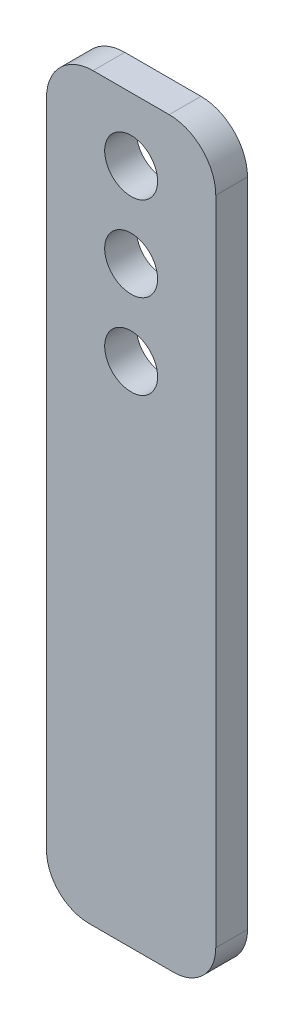
ISO-10303-21;
HEADER;
FILE_DESCRIPTION(('STEP AP214'),'2;1');
FILE_NAME('part.step','',(''),(''),'','','');
FILE_SCHEMA(('AUTOMOTIVE_DESIGN { 1 0 10303 214 1 1 1 1 }'));
ENDSEC;
DATA;
#1=APPLICATION_CONTEXT('core data for automotive mechanical design processes');
#2=APPLICATION_PROTOCOL_DEFINITION('international standard','automotive_design',2000,#1);
#3=PRODUCT_CONTEXT('',#1,'mechanical');
#4=PRODUCT('Part','Part','',(#3));
#5=PRODUCT_RELATED_PRODUCT_CATEGORY('part','',(#4));
#6=PRODUCT_DEFINITION_FORMATION('','',#4);
#7=PRODUCT_DEFINITION_CONTEXT('part definition',#1,'design');
#8=PRODUCT_DEFINITION('design','',#6,#7);
#9=PRODUCT_DEFINITION_SHAPE('','',#8);
#10=(LENGTH_UNIT() NAMED_UNIT(*) SI_UNIT(.MILLI.,.METRE.));
#11=(NAMED_UNIT(*) PLANE_ANGLE_UNIT() SI_UNIT($,.RADIAN.));
#12=(NAMED_UNIT(*) SI_UNIT($,.STERADIAN.) SOLID_ANGLE_UNIT());
#13=UNCERTAINTY_MEASURE_WITH_UNIT(LENGTH_MEASURE(1.E-05),#10,'distance_accuracy_value','');
#14=(GEOMETRIC_REPRESENTATION_CONTEXT(3) GLOBAL_UNCERTAINTY_ASSIGNED_CONTEXT((#13)) GLOBAL_UNIT_ASSIGNED_CONTEXT((#10,
#11,#12)) REPRESENTATION_CONTEXT('',''));
#15=CARTESIAN_POINT('',(0.,0.,0.));
#16=DIRECTION('',(0.,0.,1.));
#17=DIRECTION('',(1.,0.,0.));
#18=AXIS2_PLACEMENT_3D('',#15,#16,#17);
#19=CARTESIAN_POINT('',(18.,-22.,15.));
#20=DIRECTION('',(0.,0.,1.));
#21=DIRECTION('',(1.,0.,0.));
#22=AXIS2_PLACEMENT_3D('',#19,#20,#21);
#23=PLANE('',#22);
#24=CARTESIAN_POINT('',(0.,-70.,15.));
#25=DIRECTION('',(0.,0.,1.));
#26=DIRECTION('',(1.,0.,0.));
#27=AXIS2_PLACEMENT_3D('',#24,#25,#26);
#28=CIRCLE('',#27,12.5);
#29=CARTESIAN_POINT('',(12.5,-70.,15.));
#30=VERTEX_POINT('',#29);
#31=EDGE_CURVE('E160',#30,#30,#28,.T.);
#32=ORIENTED_EDGE('',*,*,#31,.F.);
#33=EDGE_LOOP('',(#32));
#34=FACE_BOUND('',#33,.T.);
#35=CARTESIAN_POINT('',(18.,-22.,15.));
#36=DIRECTION('',(0.,0.,1.));
#37=DIRECTION('',(1.,0.,0.));
#38=AXIS2_PLACEMENT_3D('',#35,#36,#37);
#39=CIRCLE('',#38,22.);
#40=CARTESIAN_POINT('',(40.,-22.,15.));
#41=VERTEX_POINT('',#40);
#42=CARTESIAN_POINT('',(18.,0.,15.));
#43=VERTEX_POINT('',#42);
#44=EDGE_CURVE('E161',#41,#43,#39,.T.);
#45=ORIENTED_EDGE('',*,*,#44,.T.);
#46=DIRECTION('',(-1.,0.,0.));
#47=VECTOR('',#46,1.);
#48=CARTESIAN_POINT('',(-18.,0.,15.));
#49=LINE('',#48,#47);
#50=CARTESIAN_POINT('',(-18.,0.,15.));
#51=VERTEX_POINT('',#50);
#52=EDGE_CURVE('E100',#43,#51,#49,.T.);
#53=ORIENTED_EDGE('',*,*,#52,.T.);
#54=CARTESIAN_POINT('',(-18.,-22.,15.));
#55=DIRECTION('',(0.,0.,1.));
#56=DIRECTION('',(-1.,0.,0.));
#57=AXIS2_PLACEMENT_3D('',#54,#55,#56);
#58=CIRCLE('',#57,22.);
#59=CARTESIAN_POINT('',(-40.,-22.,15.));
#60=VERTEX_POINT('',#59);
#61=EDGE_CURVE('E173',#51,#60,#58,.T.);
#62=ORIENTED_EDGE('',*,*,#61,.T.);
#63=DIRECTION('',(0.,-1.,0.));
#64=VECTOR('',#63,1.);
#65=CARTESIAN_POINT('',(-40.,-330.,15.));
#66=LINE('',#65,#64);
#67=CARTESIAN_POINT('',(-40.,-330.,15.));
#68=VERTEX_POINT('',#67);
#69=EDGE_CURVE('E176',#60,#68,#66,.T.);
#70=ORIENTED_EDGE('',*,*,#69,.T.);
#71=CARTESIAN_POINT('',(-20.,-330.,15.));
#72=DIRECTION('',(0.,0.,1.));
#73=DIRECTION('',(1.,0.,0.));
#74=AXIS2_PLACEMENT_3D('',#71,#72,#73);
#75=CIRCLE('',#74,20.);
#76=CARTESIAN_POINT('',(-20.,-350.,15.));
#77=VERTEX_POINT('',#76);
#78=EDGE_CURVE('E119',#68,#77,#75,.T.);
#79=ORIENTED_EDGE('',*,*,#78,.T.);
#80=DIRECTION('',(1.,0.,0.));
#81=VECTOR('',#80,1.);
#82=CARTESIAN_POINT('',(-20.,-350.,15.));
#83=LINE('',#82,#81);
#84=CARTESIAN_POINT('',(20.,-350.,15.));
#85=VERTEX_POINT('',#84);
#86=EDGE_CURVE('E113',#77,#85,#83,.T.);
#87=ORIENTED_EDGE('',*,*,#86,.T.);
#88=CARTESIAN_POINT('',(20.,-330.,15.));
#89=DIRECTION('',(0.,0.,1.));
#90=DIRECTION('',(-1.,0.,0.));
#91=AXIS2_PLACEMENT_3D('',#88,#89,#90);
#92=CIRCLE('',#91,20.);
#93=CARTESIAN_POINT('',(40.,-330.,15.));
#94=VERTEX_POINT('',#93);
#95=EDGE_CURVE('E117',#85,#94,#92,.T.);
#96=ORIENTED_EDGE('',*,*,#95,.T.);
#97=DIRECTION('',(0.,1.,0.));
#98=VECTOR('',#97,1.);
#99=CARTESIAN_POINT('',(40.,-330.,15.));
#100=LINE('',#99,#98);
#101=EDGE_CURVE('E57',#94,#41,#100,.T.);
#102=ORIENTED_EDGE('',*,*,#101,.T.);
#103=EDGE_LOOP('',(#45,#53,#62,#70,#79,#87,#96,#102));
#104=FACE_BOUND('',#103,.T.);
#105=CARTESIAN_POINT('',(0.,-30.,15.));
#106=DIRECTION('',(0.,0.,1.));
#107=DIRECTION('',(1.,0.,0.));
#108=AXIS2_PLACEMENT_3D('',#105,#106,#107);
#109=CIRCLE('',#108,12.5);
#110=CARTESIAN_POINT('',(12.5,-30.,15.));
#111=VERTEX_POINT('',#110);
#112=EDGE_CURVE('E148',#111,#111,#109,.T.);
#113=ORIENTED_EDGE('',*,*,#112,.F.);
#114=EDGE_LOOP('',(#113));
#115=FACE_BOUND('',#114,.T.);
#116=CARTESIAN_POINT('',(0.,-110.,15.));
#117=DIRECTION('',(0.,0.,1.));
#118=DIRECTION('',(1.,0.,0.));
#119=AXIS2_PLACEMENT_3D('',#116,#117,#118);
#120=CIRCLE('',#119,12.5);
#121=CARTESIAN_POINT('',(12.5,-110.,15.));
#122=VERTEX_POINT('',#121);
#123=EDGE_CURVE('E187',#122,#122,#120,.T.);
#124=ORIENTED_EDGE('',*,*,#123,.F.);
#125=EDGE_LOOP('',(#124));
#126=FACE_BOUND('',#125,.T.);
#127=ADVANCED_FACE('F40',(#34,#104,#115,#126),#23,.T.);
#128=CARTESIAN_POINT('',(18.,-22.,0.));
#129=DIRECTION('',(0.,0.,1.));
#130=DIRECTION('',(1.,0.,0.));
#131=AXIS2_PLACEMENT_3D('',#128,#129,#130);
#132=PLANE('',#131);
#133=CARTESIAN_POINT('',(18.,-22.,0.));
#134=DIRECTION('',(0.,0.,1.));
#135=DIRECTION('',(1.,0.,0.));
#136=AXIS2_PLACEMENT_3D('',#133,#134,#135);
#137=CIRCLE('',#136,22.);
#138=CARTESIAN_POINT('',(40.,-22.,0.));
#139=VERTEX_POINT('',#138);
#140=CARTESIAN_POINT('',(18.,0.,0.));
#141=VERTEX_POINT('',#140);
#142=EDGE_CURVE('E154',#139,#141,#137,.T.);
#143=ORIENTED_EDGE('',*,*,#142,.F.);
#144=DIRECTION('',(0.,1.,0.));
#145=VECTOR('',#144,1.);
#146=CARTESIAN_POINT('',(40.,-330.,0.));
#147=LINE('',#146,#145);
#148=CARTESIAN_POINT('',(40.,-330.,0.));
#149=VERTEX_POINT('',#148);
#150=EDGE_CURVE('E92',#149,#139,#147,.T.);
#151=ORIENTED_EDGE('',*,*,#150,.F.);
#152=CARTESIAN_POINT('',(20.,-330.,0.));
#153=DIRECTION('',(0.,0.,1.));
#154=DIRECTION('',(-1.,0.,0.));
#155=AXIS2_PLACEMENT_3D('',#152,#153,#154);
#156=CIRCLE('',#155,20.);
#157=CARTESIAN_POINT('',(20.,-350.,0.));
#158=VERTEX_POINT('',#157);
#159=EDGE_CURVE('E86',#158,#149,#156,.T.);
#160=ORIENTED_EDGE('',*,*,#159,.F.);
#161=DIRECTION('',(1.,0.,0.));
#162=VECTOR('',#161,1.);
#163=CARTESIAN_POINT('',(-20.,-350.,0.));
#164=LINE('',#163,#162);
#165=CARTESIAN_POINT('',(-20.,-350.,0.));
#166=VERTEX_POINT('',#165);
#167=EDGE_CURVE('E128',#166,#158,#164,.T.);
#168=ORIENTED_EDGE('',*,*,#167,.F.);
#169=CARTESIAN_POINT('',(-20.,-330.,0.));
#170=DIRECTION('',(0.,0.,1.));
#171=DIRECTION('',(1.,0.,0.));
#172=AXIS2_PLACEMENT_3D('',#169,#170,#171);
#173=CIRCLE('',#172,20.);
#174=CARTESIAN_POINT('',(-40.,-330.,0.));
#175=VERTEX_POINT('',#174);
#176=EDGE_CURVE('E254',#175,#166,#173,.T.);
#177=ORIENTED_EDGE('',*,*,#176,.F.);
#178=DIRECTION('',(0.,-1.,0.));
#179=VECTOR('',#178,1.);
#180=CARTESIAN_POINT('',(-40.,-330.,0.));
#181=LINE('',#180,#179);
#182=CARTESIAN_POINT('',(-40.,-22.,0.));
#183=VERTEX_POINT('',#182);
#184=EDGE_CURVE('E252',#183,#175,#181,.T.);
#185=ORIENTED_EDGE('',*,*,#184,.F.);
#186=CARTESIAN_POINT('',(-18.,-22.,0.));
#187=DIRECTION('',(0.,0.,1.));
#188=DIRECTION('',(-1.,0.,0.));
#189=AXIS2_PLACEMENT_3D('',#186,#187,#188);
#190=CIRCLE('',#189,22.);
#191=CARTESIAN_POINT('',(-18.,0.,0.));
#192=VERTEX_POINT('',#191);
#193=EDGE_CURVE('E244',#192,#183,#190,.T.);
#194=ORIENTED_EDGE('',*,*,#193,.F.);
#195=DIRECTION('',(-1.,0.,0.));
#196=VECTOR('',#195,1.);
#197=CARTESIAN_POINT('',(-18.,0.,0.));
#198=LINE('',#197,#196);
#199=EDGE_CURVE('E237',#141,#192,#198,.T.);
#200=ORIENTED_EDGE('',*,*,#199,.F.);
#201=EDGE_LOOP('',(#143,#151,#160,#168,#177,#185,#194,#200));
#202=FACE_BOUND('',#201,.T.);
#203=CARTESIAN_POINT('',(0.,-30.,0.));
#204=DIRECTION('',(0.,0.,1.));
#205=DIRECTION('',(1.,0.,0.));
#206=AXIS2_PLACEMENT_3D('',#203,#204,#205);
#207=CIRCLE('',#206,12.5);
#208=CARTESIAN_POINT('',(12.5,-30.,0.));
#209=VERTEX_POINT('',#208);
#210=EDGE_CURVE('E155',#209,#209,#207,.T.);
#211=ORIENTED_EDGE('',*,*,#210,.T.);
#212=EDGE_LOOP('',(#211));
#213=FACE_BOUND('',#212,.T.);
#214=CARTESIAN_POINT('',(0.,-70.,0.));
#215=DIRECTION('',(0.,0.,1.));
#216=DIRECTION('',(1.,0.,0.));
#217=AXIS2_PLACEMENT_3D('',#214,#215,#216);
#218=CIRCLE('',#217,12.5);
#219=CARTESIAN_POINT('',(12.5,-70.,0.));
#220=VERTEX_POINT('',#219);
#221=EDGE_CURVE('E156',#220,#220,#218,.T.);
#222=ORIENTED_EDGE('',*,*,#221,.T.);
#223=EDGE_LOOP('',(#222));
#224=FACE_BOUND('',#223,.T.);
#225=CARTESIAN_POINT('',(0.,-110.,0.));
#226=DIRECTION('',(0.,0.,1.));
#227=DIRECTION('',(1.,0.,0.));
#228=AXIS2_PLACEMENT_3D('',#225,#226,#227);
#229=CIRCLE('',#228,12.5);
#230=CARTESIAN_POINT('',(12.5,-110.,0.));
#231=VERTEX_POINT('',#230);
#232=EDGE_CURVE('E190',#231,#231,#229,.T.);
#233=ORIENTED_EDGE('',*,*,#232,.T.);
#234=EDGE_LOOP('',(#233));
#235=FACE_BOUND('',#234,.T.);
#236=ADVANCED_FACE('F201',(#202,#213,#224,#235),#132,.F.);
#237=CARTESIAN_POINT('',(18.,-22.,15.));
#238=DIRECTION('',(0.,0.,-1.));
#239=DIRECTION('',(-1.,0.,0.));
#240=AXIS2_PLACEMENT_3D('',#237,#238,#239);
#241=CYLINDRICAL_SURFACE('',#240,22.);
#242=ORIENTED_EDGE('',*,*,#142,.T.);
#243=DIRECTION('',(0.,0.,-1.));
#244=VECTOR('',#243,1.);
#245=CARTESIAN_POINT('',(18.,0.,15.));
#246=LINE('',#245,#244);
#247=EDGE_CURVE('E12',#43,#141,#246,.T.);
#248=ORIENTED_EDGE('',*,*,#247,.F.);
#249=ORIENTED_EDGE('',*,*,#44,.F.);
#250=DIRECTION('',(0.,0.,-1.));
#251=VECTOR('',#250,1.);
#252=CARTESIAN_POINT('',(40.,-22.,15.));
#253=LINE('',#252,#251);
#254=EDGE_CURVE('E136',#41,#139,#253,.T.);
#255=ORIENTED_EDGE('',*,*,#254,.T.);
#256=EDGE_LOOP('',(#242,#248,#249,#255));
#257=FACE_BOUND('',#256,.T.);
#258=ADVANCED_FACE('F42',(#257),#241,.T.);
#259=CARTESIAN_POINT('',(-18.,0.,15.));
#260=DIRECTION('',(0.,-1.,0.));
#261=DIRECTION('',(0.,0.,-1.));
#262=AXIS2_PLACEMENT_3D('',#259,#260,#261);
#263=PLANE('',#262);
#264=ORIENTED_EDGE('',*,*,#199,.T.);
#265=DIRECTION('',(0.,0.,-1.));
#266=VECTOR('',#265,1.);
#267=CARTESIAN_POINT('',(-18.,0.,15.));
#268=LINE('',#267,#266);
#269=EDGE_CURVE('E49',#51,#192,#268,.T.);
#270=ORIENTED_EDGE('',*,*,#269,.F.);
#271=ORIENTED_EDGE('',*,*,#52,.F.);
#272=ORIENTED_EDGE('',*,*,#247,.T.);
#273=EDGE_LOOP('',(#264,#270,#271,#272));
#274=FACE_BOUND('',#273,.T.);
#275=ADVANCED_FACE('F230',(#274),#263,.F.);
#276=CARTESIAN_POINT('',(-18.,-22.,15.));
#277=DIRECTION('',(0.,0.,-1.));
#278=DIRECTION('',(-1.,0.,0.));
#279=AXIS2_PLACEMENT_3D('',#276,#277,#278);
#280=CYLINDRICAL_SURFACE('',#279,22.);
#281=ORIENTED_EDGE('',*,*,#193,.T.);
#282=DIRECTION('',(0.,0.,-1.));
#283=VECTOR('',#282,1.);
#284=CARTESIAN_POINT('',(-40.,-22.,15.));
#285=LINE('',#284,#283);
#286=EDGE_CURVE('E248',#60,#183,#285,.T.);
#287=ORIENTED_EDGE('',*,*,#286,.F.);
#288=ORIENTED_EDGE('',*,*,#61,.F.);
#289=ORIENTED_EDGE('',*,*,#269,.T.);
#290=EDGE_LOOP('',(#281,#287,#288,#289));
#291=FACE_BOUND('',#290,.T.);
#292=ADVANCED_FACE('F227',(#291),#280,.T.);
#293=CARTESIAN_POINT('',(-40.,-330.,15.));
#294=DIRECTION('',(1.,0.,0.));
#295=DIRECTION('',(0.,1.,0.));
#296=AXIS2_PLACEMENT_3D('',#293,#294,#295);
#297=PLANE('',#296);
#298=ORIENTED_EDGE('',*,*,#184,.T.);
#299=DIRECTION('',(0.,0.,-1.));
#300=VECTOR('',#299,1.);
#301=CARTESIAN_POINT('',(-40.,-330.,15.));
#302=LINE('',#301,#300);
#303=EDGE_CURVE('E264',#68,#175,#302,.T.);
#304=ORIENTED_EDGE('',*,*,#303,.F.);
#305=ORIENTED_EDGE('',*,*,#69,.F.);
#306=ORIENTED_EDGE('',*,*,#286,.T.);
#307=EDGE_LOOP('',(#298,#304,#305,#306));
#308=FACE_BOUND('',#307,.T.);
#309=ADVANCED_FACE('F223',(#308),#297,.F.);
#310=CARTESIAN_POINT('',(-20.,-330.,15.));
#311=DIRECTION('',(0.,0.,-1.));
#312=DIRECTION('',(-1.,0.,0.));
#313=AXIS2_PLACEMENT_3D('',#310,#311,#312);
#314=CYLINDRICAL_SURFACE('',#313,20.);
#315=ORIENTED_EDGE('',*,*,#176,.T.);
#316=DIRECTION('',(0.,0.,-1.));
#317=VECTOR('',#316,1.);
#318=CARTESIAN_POINT('',(-20.,-350.,15.));
#319=LINE('',#318,#317);
#320=EDGE_CURVE('E129',#77,#166,#319,.T.);
#321=ORIENTED_EDGE('',*,*,#320,.F.);
#322=ORIENTED_EDGE('',*,*,#78,.F.);
#323=ORIENTED_EDGE('',*,*,#303,.T.);
#324=EDGE_LOOP('',(#315,#321,#322,#323));
#325=FACE_BOUND('',#324,.T.);
#326=ADVANCED_FACE('F220',(#325),#314,.T.);
#327=CARTESIAN_POINT('',(-20.,-350.,15.));
#328=DIRECTION('',(0.,1.,0.));
#329=DIRECTION('',(0.,0.,1.));
#330=AXIS2_PLACEMENT_3D('',#327,#328,#329);
#331=PLANE('',#330);
#332=ORIENTED_EDGE('',*,*,#167,.T.);
#333=DIRECTION('',(0.,0.,-1.));
#334=VECTOR('',#333,1.);
#335=CARTESIAN_POINT('',(20.,-350.,15.));
#336=LINE('',#335,#334);
#337=EDGE_CURVE('E125',#85,#158,#336,.T.);
#338=ORIENTED_EDGE('',*,*,#337,.F.);
#339=ORIENTED_EDGE('',*,*,#86,.F.);
#340=ORIENTED_EDGE('',*,*,#320,.T.);
#341=EDGE_LOOP('',(#332,#338,#339,#340));
#342=FACE_BOUND('',#341,.T.);
#343=ADVANCED_FACE('F126',(#342),#331,.F.);
#344=CARTESIAN_POINT('',(20.,-330.,15.));
#345=DIRECTION('',(0.,0.,-1.));
#346=DIRECTION('',(-1.,0.,0.));
#347=AXIS2_PLACEMENT_3D('',#344,#345,#346);
#348=CYLINDRICAL_SURFACE('',#347,20.);
#349=ORIENTED_EDGE('',*,*,#159,.T.);
#350=DIRECTION('',(0.,0.,-1.));
#351=VECTOR('',#350,1.);
#352=CARTESIAN_POINT('',(40.,-330.,15.));
#353=LINE('',#352,#351);
#354=EDGE_CURVE('E130',#94,#149,#353,.T.);
#355=ORIENTED_EDGE('',*,*,#354,.F.);
#356=ORIENTED_EDGE('',*,*,#95,.F.);
#357=ORIENTED_EDGE('',*,*,#337,.T.);
#358=EDGE_LOOP('',(#349,#355,#356,#357));
#359=FACE_BOUND('',#358,.T.);
#360=ADVANCED_FACE('F132',(#359),#348,.T.);
#361=CARTESIAN_POINT('',(40.,-330.,15.));
#362=DIRECTION('',(-1.,0.,0.));
#363=DIRECTION('',(0.,-1.,0.));
#364=AXIS2_PLACEMENT_3D('',#361,#362,#363);
#365=PLANE('',#364);
#366=ORIENTED_EDGE('',*,*,#150,.T.);
#367=ORIENTED_EDGE('',*,*,#254,.F.);
#368=ORIENTED_EDGE('',*,*,#101,.F.);
#369=ORIENTED_EDGE('',*,*,#354,.T.);
#370=EDGE_LOOP('',(#366,#367,#368,#369));
#371=FACE_BOUND('',#370,.T.);
#372=ADVANCED_FACE('F213',(#371),#365,.F.);
#373=CARTESIAN_POINT('',(0.,-30.,15.));
#374=DIRECTION('',(0.,0.,-1.));
#375=DIRECTION('',(-1.,0.,0.));
#376=AXIS2_PLACEMENT_3D('',#373,#374,#375);
#377=CYLINDRICAL_SURFACE('',#376,12.5);
#378=ORIENTED_EDGE('',*,*,#112,.T.);
#379=EDGE_LOOP('',(#378));
#380=FACE_BOUND('',#379,.T.);
#381=ORIENTED_EDGE('',*,*,#210,.F.);
#382=EDGE_LOOP('',(#381));
#383=FACE_BOUND('',#382,.T.);
#384=ADVANCED_FACE('F210',(#380,#383),#377,.F.);
#385=CARTESIAN_POINT('',(0.,-70.,15.));
#386=DIRECTION('',(0.,0.,-1.));
#387=DIRECTION('',(-1.,0.,0.));
#388=AXIS2_PLACEMENT_3D('',#385,#386,#387);
#389=CYLINDRICAL_SURFACE('',#388,12.5);
#390=ORIENTED_EDGE('',*,*,#31,.T.);
#391=EDGE_LOOP('',(#390));
#392=FACE_BOUND('',#391,.T.);
#393=ORIENTED_EDGE('',*,*,#221,.F.);
#394=EDGE_LOOP('',(#393));
#395=FACE_BOUND('',#394,.T.);
#396=ADVANCED_FACE('F276',(#392,#395),#389,.F.);
#397=CARTESIAN_POINT('',(0.,-110.,15.));
#398=DIRECTION('',(0.,0.,-1.));
#399=DIRECTION('',(-1.,0.,0.));
#400=AXIS2_PLACEMENT_3D('',#397,#398,#399);
#401=CYLINDRICAL_SURFACE('',#400,12.5);
#402=ORIENTED_EDGE('',*,*,#123,.T.);
#403=EDGE_LOOP('',(#402));
#404=FACE_BOUND('',#403,.T.);
#405=ORIENTED_EDGE('',*,*,#232,.F.);
#406=EDGE_LOOP('',(#405));
#407=FACE_BOUND('',#406,.T.);
#408=ADVANCED_FACE('F197',(#404,#407),#401,.F.);
#409=CLOSED_SHELL('',(#127,#236,#258,#275,#292,#309,#326,#343,#360,#372,#384,#396,#408));
#410=MANIFOLD_SOLID_BREP('B2',#409);
#411=ADVANCED_BREP_SHAPE_REPRESENTATION('',(#18,#410),#14);
#412=SHAPE_DEFINITION_REPRESENTATION(#9,#411);
ENDSEC;
END-ISO-10303-21;
